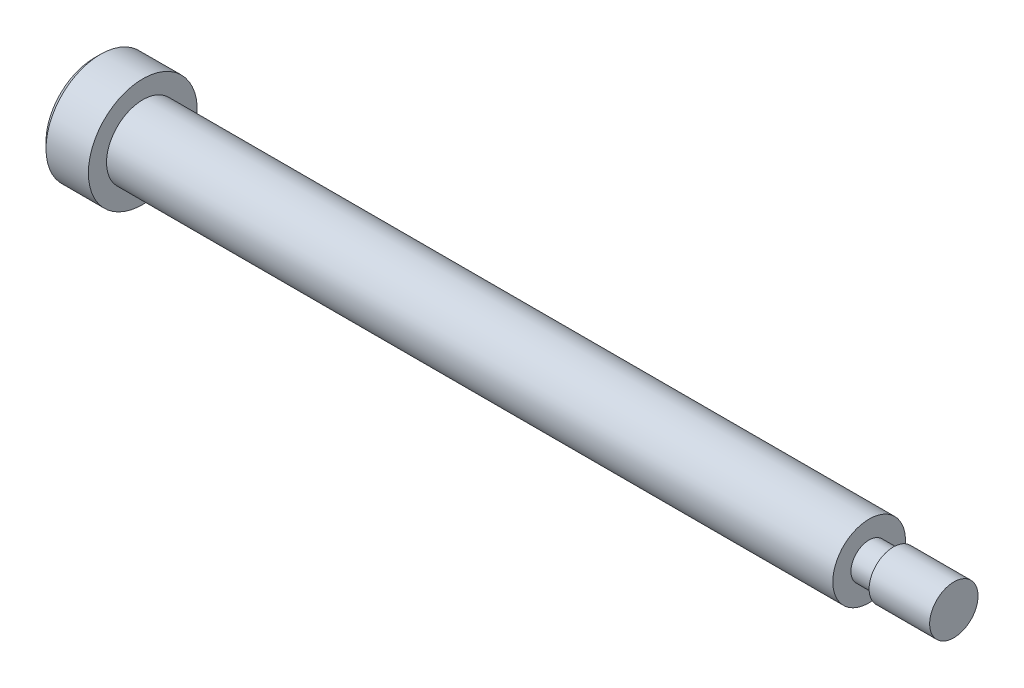
ISO-10303-21;
HEADER;
FILE_DESCRIPTION(('STEP AP214'),'2;1');
FILE_NAME('part.step','',(''),(''),'','','');
FILE_SCHEMA(('AUTOMOTIVE_DESIGN { 1 0 10303 214 1 1 1 1 }'));
ENDSEC;
DATA;
#1=APPLICATION_CONTEXT('core data for automotive mechanical design processes');
#2=APPLICATION_PROTOCOL_DEFINITION('international standard','automotive_design',2000,#1);
#3=PRODUCT_CONTEXT('',#1,'mechanical');
#4=PRODUCT('Part','Part','',(#3));
#5=PRODUCT_RELATED_PRODUCT_CATEGORY('part','',(#4));
#6=PRODUCT_DEFINITION_FORMATION('','',#4);
#7=PRODUCT_DEFINITION_CONTEXT('part definition',#1,'design');
#8=PRODUCT_DEFINITION('design','',#6,#7);
#9=PRODUCT_DEFINITION_SHAPE('','',#8);
#10=(LENGTH_UNIT() NAMED_UNIT(*) SI_UNIT(.MILLI.,.METRE.));
#11=(NAMED_UNIT(*) PLANE_ANGLE_UNIT() SI_UNIT($,.RADIAN.));
#12=(NAMED_UNIT(*) SI_UNIT($,.STERADIAN.) SOLID_ANGLE_UNIT());
#13=UNCERTAINTY_MEASURE_WITH_UNIT(LENGTH_MEASURE(1.E-05),#10,'distance_accuracy_value','');
#14=(GEOMETRIC_REPRESENTATION_CONTEXT(3) GLOBAL_UNCERTAINTY_ASSIGNED_CONTEXT((#13)) GLOBAL_UNIT_ASSIGNED_CONTEXT((#10,
#11,#12)) REPRESENTATION_CONTEXT('',''));
#15=CARTESIAN_POINT('',(0.,0.,0.));
#16=DIRECTION('',(0.,0.,1.));
#17=DIRECTION('',(1.,0.,0.));
#18=AXIS2_PLACEMENT_3D('',#15,#16,#17);
#19=CARTESIAN_POINT('',(0.,4.5,0.));
#20=DIRECTION('',(-1.,0.,0.));
#21=DIRECTION('',(0.,0.,1.));
#22=AXIS2_PLACEMENT_3D('',#19,#20,#21);
#23=PLANE('',#22);
#24=CARTESIAN_POINT('',(0.,0.,0.));
#25=DIRECTION('',(-1.,0.,0.));
#26=DIRECTION('',(0.,0.,1.));
#27=AXIS2_PLACEMENT_3D('',#24,#25,#26);
#28=CIRCLE('',#27,4.5);
#29=CARTESIAN_POINT('',(0.,0.,4.5));
#30=VERTEX_POINT('',#29);
#31=EDGE_CURVE('E156',#30,#30,#28,.T.);
#32=ORIENTED_EDGE('',*,*,#31,.F.);
#33=EDGE_LOOP('',(#32));
#34=FACE_BOUND('',#33,.T.);
#35=CARTESIAN_POINT('',(0.,0.,0.));
#36=DIRECTION('',(-1.,0.,0.));
#37=DIRECTION('',(0.,0.,1.));
#38=AXIS2_PLACEMENT_3D('',#35,#36,#37);
#39=CIRCLE('',#38,3.);
#40=CARTESIAN_POINT('',(0.,0.,3.));
#41=VERTEX_POINT('',#40);
#42=EDGE_CURVE('E133',#41,#41,#39,.T.);
#43=ORIENTED_EDGE('',*,*,#42,.T.);
#44=EDGE_LOOP('',(#43));
#45=FACE_BOUND('',#44,.T.);
#46=ADVANCED_FACE('F31',(#34,#45),#23,.F.);
#47=CARTESIAN_POINT('',(-15.4482466475727,0.,0.));
#48=DIRECTION('',(-1.,0.,0.));
#49=DIRECTION('',(0.,0.,1.));
#50=AXIS2_PLACEMENT_3D('',#47,#48,#49);
#51=CYLINDRICAL_SURFACE('',#50,4.5);
#52=CARTESIAN_POINT('',(-3.49999999999999,0.,0.));
#53=DIRECTION('',(1.,0.,0.));
#54=DIRECTION('',(0.,0.,-1.));
#55=AXIS2_PLACEMENT_3D('',#52,#53,#54);
#56=CIRCLE('',#55,4.5);
#57=CARTESIAN_POINT('',(-3.49999999999999,0.,-4.5));
#58=VERTEX_POINT('',#57);
#59=EDGE_CURVE('E11',#58,#58,#56,.T.);
#60=ORIENTED_EDGE('',*,*,#59,.T.);
#61=EDGE_LOOP('',(#60));
#62=FACE_BOUND('',#61,.T.);
#63=ORIENTED_EDGE('',*,*,#31,.T.);
#64=EDGE_LOOP('',(#63));
#65=FACE_BOUND('',#64,.T.);
#66=ADVANCED_FACE('F178',(#62,#65),#51,.T.);
#67=CARTESIAN_POINT('',(-4.,0.,0.));
#68=DIRECTION('',(1.,0.,0.));
#69=DIRECTION('',(0.,0.,-1.));
#70=AXIS2_PLACEMENT_3D('',#67,#68,#69);
#71=PLANE('',#70);
#72=DIRECTION('',(0.,-0.5,-0.866025403784439));
#73=VECTOR('',#72,1.);
#74=CARTESIAN_POINT('',(-4.,1.73205080756888,0.));
#75=LINE('',#74,#73);
#76=CARTESIAN_POINT('',(-4.,1.73205080756888,0.));
#77=VERTEX_POINT('',#76);
#78=CARTESIAN_POINT('',(-4.,0.866025403784438,-1.5));
#79=VERTEX_POINT('',#78);
#80=EDGE_CURVE('E120',#77,#79,#75,.T.);
#81=ORIENTED_EDGE('',*,*,#80,.F.);
#82=DIRECTION('',(0.,0.5,-0.866025403784439));
#83=VECTOR('',#82,1.);
#84=CARTESIAN_POINT('',(-4.,0.86602540378444,1.5));
#85=LINE('',#84,#83);
#86=CARTESIAN_POINT('',(-4.,0.86602540378444,1.5));
#87=VERTEX_POINT('',#86);
#88=EDGE_CURVE('E46',#87,#77,#85,.T.);
#89=ORIENTED_EDGE('',*,*,#88,.F.);
#90=DIRECTION('',(0.,1.,0.));
#91=VECTOR('',#90,1.);
#92=CARTESIAN_POINT('',(-4.,-0.866025403784439,1.5));
#93=LINE('',#92,#91);
#94=CARTESIAN_POINT('',(-4.,-0.866025403784439,1.5));
#95=VERTEX_POINT('',#94);
#96=EDGE_CURVE('E129',#95,#87,#93,.T.);
#97=ORIENTED_EDGE('',*,*,#96,.F.);
#98=DIRECTION('',(0.,0.5,0.866025403784438));
#99=VECTOR('',#98,1.);
#100=CARTESIAN_POINT('',(-4.,-1.73205080756888,0.));
#101=LINE('',#100,#99);
#102=CARTESIAN_POINT('',(-4.,-1.73205080756888,0.));
#103=VERTEX_POINT('',#102);
#104=EDGE_CURVE('E127',#103,#95,#101,.T.);
#105=ORIENTED_EDGE('',*,*,#104,.F.);
#106=DIRECTION('',(0.,-0.5,0.866025403784439));
#107=VECTOR('',#106,1.);
#108=CARTESIAN_POINT('',(-4.,-0.866025403784439,-1.5));
#109=LINE('',#108,#107);
#110=CARTESIAN_POINT('',(-4.,-0.866025403784439,-1.5));
#111=VERTEX_POINT('',#110);
#112=EDGE_CURVE('E94',#111,#103,#109,.T.);
#113=ORIENTED_EDGE('',*,*,#112,.F.);
#114=DIRECTION('',(0.,-1.,0.));
#115=VECTOR('',#114,1.);
#116=CARTESIAN_POINT('',(-4.,0.866025403784438,-1.5));
#117=LINE('',#116,#115);
#118=EDGE_CURVE('E123',#79,#111,#117,.T.);
#119=ORIENTED_EDGE('',*,*,#118,.F.);
#120=EDGE_LOOP('',(#81,#89,#97,#105,#113,#119));
#121=FACE_BOUND('',#120,.T.);
#122=CARTESIAN_POINT('',(-4.,0.,0.));
#123=DIRECTION('',(1.,0.,0.));
#124=DIRECTION('',(0.,0.,-1.));
#125=AXIS2_PLACEMENT_3D('',#122,#123,#124);
#126=CIRCLE('',#125,4.);
#127=CARTESIAN_POINT('',(-4.,0.,-4.));
#128=VERTEX_POINT('',#127);
#129=EDGE_CURVE('E39',#128,#128,#126,.F.);
#130=ORIENTED_EDGE('',*,*,#129,.T.);
#131=EDGE_LOOP('',(#130));
#132=FACE_BOUND('',#131,.T.);
#133=ADVANCED_FACE('F161',(#121,#132),#71,.F.);
#134=CARTESIAN_POINT('',(67.,2.,0.));
#135=DIRECTION('',(-1.,0.,0.));
#136=DIRECTION('',(0.,0.,1.));
#137=AXIS2_PLACEMENT_3D('',#134,#135,#136);
#138=PLANE('',#137);
#139=CARTESIAN_POINT('',(67.,0.,0.));
#140=DIRECTION('',(-1.,0.,0.));
#141=DIRECTION('',(0.,0.,1.));
#142=AXIS2_PLACEMENT_3D('',#139,#140,#141);
#143=CIRCLE('',#142,2.);
#144=CARTESIAN_POINT('',(67.,0.,2.));
#145=VERTEX_POINT('',#144);
#146=EDGE_CURVE('E153',#145,#145,#143,.T.);
#147=ORIENTED_EDGE('',*,*,#146,.F.);
#148=EDGE_LOOP('',(#147));
#149=FACE_BOUND('',#148,.T.);
#150=ADVANCED_FACE('F190',(#149),#138,.F.);
#151=CARTESIAN_POINT('',(-15.4482466475727,0.,0.));
#152=DIRECTION('',(-1.,0.,0.));
#153=DIRECTION('',(0.,0.,1.));
#154=AXIS2_PLACEMENT_3D('',#151,#152,#153);
#155=CYLINDRICAL_SURFACE('',#154,2.);
#156=CARTESIAN_POINT('',(62.,0.,0.));
#157=DIRECTION('',(-1.,0.,0.));
#158=DIRECTION('',(0.,0.,1.));
#159=AXIS2_PLACEMENT_3D('',#156,#157,#158);
#160=CIRCLE('',#159,2.);
#161=CARTESIAN_POINT('',(62.,0.,2.));
#162=VERTEX_POINT('',#161);
#163=EDGE_CURVE('E150',#162,#162,#160,.T.);
#164=ORIENTED_EDGE('',*,*,#163,.F.);
#165=EDGE_LOOP('',(#164));
#166=FACE_BOUND('',#165,.T.);
#167=ORIENTED_EDGE('',*,*,#146,.T.);
#168=EDGE_LOOP('',(#167));
#169=FACE_BOUND('',#168,.T.);
#170=ADVANCED_FACE('F194',(#166,#169),#155,.T.);
#171=CARTESIAN_POINT('',(62.,1.5,0.));
#172=DIRECTION('',(1.,0.,0.));
#173=DIRECTION('',(0.,0.,-1.));
#174=AXIS2_PLACEMENT_3D('',#171,#172,#173);
#175=PLANE('',#174);
#176=CARTESIAN_POINT('',(62.,0.,0.));
#177=DIRECTION('',(-1.,0.,0.));
#178=DIRECTION('',(0.,0.,1.));
#179=AXIS2_PLACEMENT_3D('',#176,#177,#178);
#180=CIRCLE('',#179,1.5);
#181=CARTESIAN_POINT('',(62.,0.,1.5));
#182=VERTEX_POINT('',#181);
#183=EDGE_CURVE('E147',#182,#182,#180,.T.);
#184=ORIENTED_EDGE('',*,*,#183,.F.);
#185=EDGE_LOOP('',(#184));
#186=FACE_BOUND('',#185,.T.);
#187=ORIENTED_EDGE('',*,*,#163,.T.);
#188=EDGE_LOOP('',(#187));
#189=FACE_BOUND('',#188,.T.);
#190=ADVANCED_FACE('F198',(#186,#189),#175,.F.);
#191=CARTESIAN_POINT('',(-15.4482466475727,0.,0.));
#192=DIRECTION('',(-1.,0.,0.));
#193=DIRECTION('',(0.,0.,1.));
#194=AXIS2_PLACEMENT_3D('',#191,#192,#193);
#195=CYLINDRICAL_SURFACE('',#194,1.5);
#196=CARTESIAN_POINT('',(60.,0.,0.));
#197=DIRECTION('',(-1.,0.,0.));
#198=DIRECTION('',(0.,0.,1.));
#199=AXIS2_PLACEMENT_3D('',#196,#197,#198);
#200=CIRCLE('',#199,1.5);
#201=CARTESIAN_POINT('',(60.,0.,1.5));
#202=VERTEX_POINT('',#201);
#203=EDGE_CURVE('E144',#202,#202,#200,.T.);
#204=ORIENTED_EDGE('',*,*,#203,.F.);
#205=EDGE_LOOP('',(#204));
#206=FACE_BOUND('',#205,.T.);
#207=ORIENTED_EDGE('',*,*,#183,.T.);
#208=EDGE_LOOP('',(#207));
#209=FACE_BOUND('',#208,.T.);
#210=ADVANCED_FACE('F202',(#206,#209),#195,.T.);
#211=CARTESIAN_POINT('',(60.,3.,0.));
#212=DIRECTION('',(-1.,0.,0.));
#213=DIRECTION('',(0.,0.,1.));
#214=AXIS2_PLACEMENT_3D('',#211,#212,#213);
#215=PLANE('',#214);
#216=CARTESIAN_POINT('',(60.,0.,0.));
#217=DIRECTION('',(-1.,0.,0.));
#218=DIRECTION('',(0.,0.,1.));
#219=AXIS2_PLACEMENT_3D('',#216,#217,#218);
#220=CIRCLE('',#219,3.);
#221=CARTESIAN_POINT('',(60.,0.,3.));
#222=VERTEX_POINT('',#221);
#223=EDGE_CURVE('E141',#222,#222,#220,.T.);
#224=ORIENTED_EDGE('',*,*,#223,.F.);
#225=EDGE_LOOP('',(#224));
#226=FACE_BOUND('',#225,.T.);
#227=ORIENTED_EDGE('',*,*,#203,.T.);
#228=EDGE_LOOP('',(#227));
#229=FACE_BOUND('',#228,.T.);
#230=ADVANCED_FACE('F173',(#226,#229),#215,.F.);
#231=CARTESIAN_POINT('',(-15.4482466475727,0.,0.));
#232=DIRECTION('',(-1.,0.,0.));
#233=DIRECTION('',(0.,0.,1.));
#234=AXIS2_PLACEMENT_3D('',#231,#232,#233);
#235=CYLINDRICAL_SURFACE('',#234,3.);
#236=ORIENTED_EDGE('',*,*,#42,.F.);
#237=EDGE_LOOP('',(#236));
#238=FACE_BOUND('',#237,.T.);
#239=ORIENTED_EDGE('',*,*,#223,.T.);
#240=EDGE_LOOP('',(#239));
#241=FACE_BOUND('',#240,.T.);
#242=ADVANCED_FACE('F165',(#238,#241),#235,.T.);
#243=CARTESIAN_POINT('',(-4.,0.,0.));
#244=DIRECTION('',(1.,0.,0.));
#245=DIRECTION('',(0.,0.,-1.));
#246=AXIS2_PLACEMENT_3D('',#243,#244,#245);
#247=CONICAL_SURFACE('',#246,4.,0.785398163397447);
#248=ORIENTED_EDGE('',*,*,#59,.F.);
#249=EDGE_LOOP('',(#248));
#250=FACE_BOUND('',#249,.T.);
#251=ORIENTED_EDGE('',*,*,#129,.F.);
#252=EDGE_LOOP('',(#251));
#253=FACE_BOUND('',#252,.T.);
#254=ADVANCED_FACE('F33',(#250,#253),#247,.T.);
#255=CARTESIAN_POINT('',(-2.,0.86602540378444,1.5));
#256=DIRECTION('',(0.,0.866025403784439,0.5));
#257=DIRECTION('',(0.,-0.5,0.866025403784439));
#258=AXIS2_PLACEMENT_3D('',#255,#256,#257);
#259=PLANE('',#258);
#260=ORIENTED_EDGE('',*,*,#88,.T.);
#261=DIRECTION('',(-1.,0.,0.));
#262=VECTOR('',#261,1.);
#263=CARTESIAN_POINT('',(-2.,1.73205080756888,0.));
#264=LINE('',#263,#262);
#265=CARTESIAN_POINT('',(-2.,1.73205080756888,0.));
#266=VERTEX_POINT('',#265);
#267=EDGE_CURVE('E76',#266,#77,#264,.T.);
#268=ORIENTED_EDGE('',*,*,#267,.F.);
#269=DIRECTION('',(0.,0.5,-0.866025403784439));
#270=VECTOR('',#269,1.);
#271=CARTESIAN_POINT('',(-2.,0.86602540378444,1.5));
#272=LINE('',#271,#270);
#273=CARTESIAN_POINT('',(-2.,0.86602540378444,1.5));
#274=VERTEX_POINT('',#273);
#275=EDGE_CURVE('E131',#274,#266,#272,.T.);
#276=ORIENTED_EDGE('',*,*,#275,.F.);
#277=DIRECTION('',(-1.,0.,0.));
#278=VECTOR('',#277,1.);
#279=CARTESIAN_POINT('',(-2.,0.86602540378444,1.5));
#280=LINE('',#279,#278);
#281=EDGE_CURVE('E54',#274,#87,#280,.T.);
#282=ORIENTED_EDGE('',*,*,#281,.T.);
#283=EDGE_LOOP('',(#260,#268,#276,#282));
#284=FACE_BOUND('',#283,.T.);
#285=ADVANCED_FACE('F164',(#284),#259,.F.);
#286=CARTESIAN_POINT('',(-2.,-0.866025403784439,1.5));
#287=DIRECTION('',(0.,0.,1.));
#288=DIRECTION('',(0.,-1.,0.));
#289=AXIS2_PLACEMENT_3D('',#286,#287,#288);
#290=PLANE('',#289);
#291=ORIENTED_EDGE('',*,*,#96,.T.);
#292=ORIENTED_EDGE('',*,*,#281,.F.);
#293=DIRECTION('',(0.,1.,0.));
#294=VECTOR('',#293,1.);
#295=CARTESIAN_POINT('',(-2.,-0.866025403784439,1.5));
#296=LINE('',#295,#294);
#297=CARTESIAN_POINT('',(-2.,-0.866025403784439,1.5));
#298=VERTEX_POINT('',#297);
#299=EDGE_CURVE('E106',#298,#274,#296,.T.);
#300=ORIENTED_EDGE('',*,*,#299,.F.);
#301=DIRECTION('',(-1.,0.,0.));
#302=VECTOR('',#301,1.);
#303=CARTESIAN_POINT('',(-2.,-0.866025403784439,1.5));
#304=LINE('',#303,#302);
#305=EDGE_CURVE('E98',#298,#95,#304,.T.);
#306=ORIENTED_EDGE('',*,*,#305,.T.);
#307=EDGE_LOOP('',(#291,#292,#300,#306));
#308=FACE_BOUND('',#307,.T.);
#309=ADVANCED_FACE('F171',(#308),#290,.F.);
#310=CARTESIAN_POINT('',(-2.,-1.73205080756888,0.));
#311=DIRECTION('',(0.,-0.866025403784439,0.5));
#312=DIRECTION('',(0.,-0.5,-0.866025403784439));
#313=AXIS2_PLACEMENT_3D('',#310,#311,#312);
#314=PLANE('',#313);
#315=ORIENTED_EDGE('',*,*,#104,.T.);
#316=ORIENTED_EDGE('',*,*,#305,.F.);
#317=DIRECTION('',(0.,0.5,0.866025403784438));
#318=VECTOR('',#317,1.);
#319=CARTESIAN_POINT('',(-2.,-1.73205080756888,0.));
#320=LINE('',#319,#318);
#321=CARTESIAN_POINT('',(-2.,-1.73205080756888,0.));
#322=VERTEX_POINT('',#321);
#323=EDGE_CURVE('E102',#322,#298,#320,.T.);
#324=ORIENTED_EDGE('',*,*,#323,.F.);
#325=DIRECTION('',(-1.,0.,0.));
#326=VECTOR('',#325,1.);
#327=CARTESIAN_POINT('',(-2.,-1.73205080756888,0.));
#328=LINE('',#327,#326);
#329=EDGE_CURVE('E87',#322,#103,#328,.T.);
#330=ORIENTED_EDGE('',*,*,#329,.T.);
#331=EDGE_LOOP('',(#315,#316,#324,#330));
#332=FACE_BOUND('',#331,.T.);
#333=ADVANCED_FACE('F103',(#332),#314,.F.);
#334=CARTESIAN_POINT('',(-2.,-0.866025403784439,-1.5));
#335=DIRECTION('',(0.,-0.866025403784439,-0.5));
#336=DIRECTION('',(0.,0.5,-0.866025403784439));
#337=AXIS2_PLACEMENT_3D('',#334,#335,#336);
#338=PLANE('',#337);
#339=ORIENTED_EDGE('',*,*,#112,.T.);
#340=ORIENTED_EDGE('',*,*,#329,.F.);
#341=DIRECTION('',(0.,-0.5,0.866025403784439));
#342=VECTOR('',#341,1.);
#343=CARTESIAN_POINT('',(-2.,-0.866025403784439,-1.5));
#344=LINE('',#343,#342);
#345=CARTESIAN_POINT('',(-2.,-0.866025403784439,-1.5));
#346=VERTEX_POINT('',#345);
#347=EDGE_CURVE('E91',#346,#322,#344,.T.);
#348=ORIENTED_EDGE('',*,*,#347,.F.);
#349=DIRECTION('',(-1.,0.,0.));
#350=VECTOR('',#349,1.);
#351=CARTESIAN_POINT('',(-2.,-0.866025403784439,-1.5));
#352=LINE('',#351,#350);
#353=EDGE_CURVE('E99',#346,#111,#352,.T.);
#354=ORIENTED_EDGE('',*,*,#353,.T.);
#355=EDGE_LOOP('',(#339,#340,#348,#354));
#356=FACE_BOUND('',#355,.T.);
#357=ADVANCED_FACE('F89',(#356),#338,.F.);
#358=CARTESIAN_POINT('',(-2.,0.866025403784438,-1.5));
#359=DIRECTION('',(0.,0.,-1.));
#360=DIRECTION('',(0.,1.,0.));
#361=AXIS2_PLACEMENT_3D('',#358,#359,#360);
#362=PLANE('',#361);
#363=ORIENTED_EDGE('',*,*,#118,.T.);
#364=ORIENTED_EDGE('',*,*,#353,.F.);
#365=DIRECTION('',(0.,-1.,0.));
#366=VECTOR('',#365,1.);
#367=CARTESIAN_POINT('',(-2.,0.866025403784438,-1.5));
#368=LINE('',#367,#366);
#369=CARTESIAN_POINT('',(-2.,0.866025403784438,-1.5));
#370=VERTEX_POINT('',#369);
#371=EDGE_CURVE('E112',#370,#346,#368,.T.);
#372=ORIENTED_EDGE('',*,*,#371,.F.);
#373=DIRECTION('',(-1.,0.,0.));
#374=VECTOR('',#373,1.);
#375=CARTESIAN_POINT('',(-2.,0.866025403784438,-1.5));
#376=LINE('',#375,#374);
#377=EDGE_CURVE('E136',#370,#79,#376,.T.);
#378=ORIENTED_EDGE('',*,*,#377,.T.);
#379=EDGE_LOOP('',(#363,#364,#372,#378));
#380=FACE_BOUND('',#379,.T.);
#381=ADVANCED_FACE('F213',(#380),#362,.F.);
#382=CARTESIAN_POINT('',(-2.,1.73205080756888,0.));
#383=DIRECTION('',(0.,0.866025403784439,-0.5));
#384=DIRECTION('',(0.,0.5,0.866025403784439));
#385=AXIS2_PLACEMENT_3D('',#382,#383,#384);
#386=PLANE('',#385);
#387=ORIENTED_EDGE('',*,*,#80,.T.);
#388=ORIENTED_EDGE('',*,*,#377,.F.);
#389=DIRECTION('',(0.,-0.5,-0.866025403784439));
#390=VECTOR('',#389,1.);
#391=CARTESIAN_POINT('',(-2.,1.73205080756888,0.));
#392=LINE('',#391,#390);
#393=EDGE_CURVE('E114',#266,#370,#392,.T.);
#394=ORIENTED_EDGE('',*,*,#393,.F.);
#395=ORIENTED_EDGE('',*,*,#267,.T.);
#396=EDGE_LOOP('',(#387,#388,#394,#395));
#397=FACE_BOUND('',#396,.T.);
#398=ADVANCED_FACE('F210',(#397),#386,.F.);
#399=CARTESIAN_POINT('',(-2.,1.73205080756888,0.));
#400=DIRECTION('',(-1.,0.,0.));
#401=DIRECTION('',(0.,0.,1.));
#402=AXIS2_PLACEMENT_3D('',#399,#400,#401);
#403=PLANE('',#402);
#404=ORIENTED_EDGE('',*,*,#275,.T.);
#405=ORIENTED_EDGE('',*,*,#393,.T.);
#406=ORIENTED_EDGE('',*,*,#371,.T.);
#407=ORIENTED_EDGE('',*,*,#347,.T.);
#408=ORIENTED_EDGE('',*,*,#323,.T.);
#409=ORIENTED_EDGE('',*,*,#299,.T.);
#410=EDGE_LOOP('',(#404,#405,#406,#407,#408,#409));
#411=FACE_BOUND('',#410,.T.);
#412=ADVANCED_FACE('F109',(#411),#403,.T.);
#413=CLOSED_SHELL('',(#46,#66,#133,#150,#170,#190,#210,#230,#242,#254,#285,#309,#333,#357,#381,
#398,#412));
#414=MANIFOLD_SOLID_BREP('B2',#413);
#415=ADVANCED_BREP_SHAPE_REPRESENTATION('',(#18,#414),#14);
#416=SHAPE_DEFINITION_REPRESENTATION(#9,#415);
ENDSEC;
END-ISO-10303-21;
